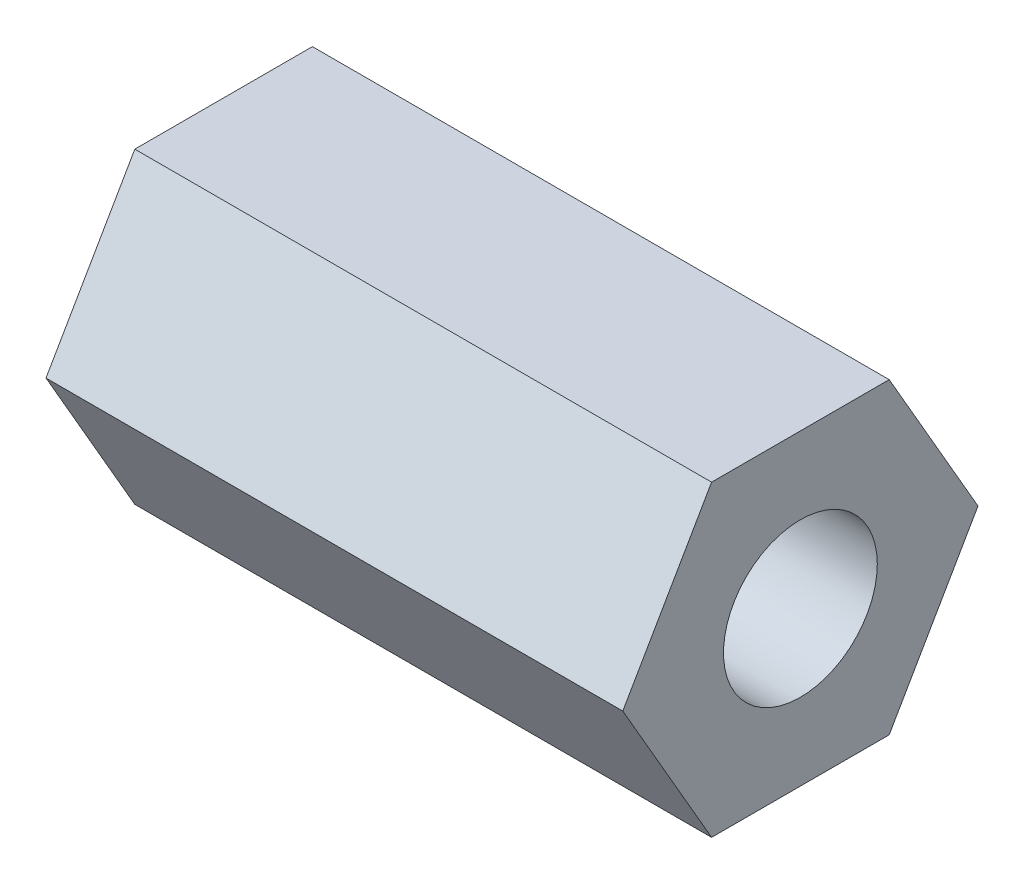
ISO-10303-21;
HEADER;
FILE_DESCRIPTION(('STEP AP214'),'2;1');
FILE_NAME('part.step','',(''),(''),'','','');
FILE_SCHEMA(('AUTOMOTIVE_DESIGN { 1 0 10303 214 1 1 1 1 }'));
ENDSEC;
DATA;
#1=APPLICATION_CONTEXT('core data for automotive mechanical design processes');
#2=APPLICATION_PROTOCOL_DEFINITION('international standard','automotive_design',2000,#1);
#3=PRODUCT_CONTEXT('',#1,'mechanical');
#4=PRODUCT('Part','Part','',(#3));
#5=PRODUCT_RELATED_PRODUCT_CATEGORY('part','',(#4));
#6=PRODUCT_DEFINITION_FORMATION('','',#4);
#7=PRODUCT_DEFINITION_CONTEXT('part definition',#1,'design');
#8=PRODUCT_DEFINITION('design','',#6,#7);
#9=PRODUCT_DEFINITION_SHAPE('','',#8);
#10=(LENGTH_UNIT() NAMED_UNIT(*) SI_UNIT(.MILLI.,.METRE.));
#11=(NAMED_UNIT(*) PLANE_ANGLE_UNIT() SI_UNIT($,.RADIAN.));
#12=(NAMED_UNIT(*) SI_UNIT($,.STERADIAN.) SOLID_ANGLE_UNIT());
#13=UNCERTAINTY_MEASURE_WITH_UNIT(LENGTH_MEASURE(1.E-05),#10,'distance_accuracy_value','');
#14=(GEOMETRIC_REPRESENTATION_CONTEXT(3) GLOBAL_UNCERTAINTY_ASSIGNED_CONTEXT((#13)) GLOBAL_UNIT_ASSIGNED_CONTEXT((#10,
#11,#12)) REPRESENTATION_CONTEXT('',''));
#15=CARTESIAN_POINT('',(0.,0.,0.));
#16=DIRECTION('',(0.,0.,1.));
#17=DIRECTION('',(1.,0.,0.));
#18=AXIS2_PLACEMENT_3D('',#15,#16,#17);
#19=CARTESIAN_POINT('',(15.,0.,0.));
#20=DIRECTION('',(1.,0.,0.));
#21=DIRECTION('',(0.,0.,-1.));
#22=AXIS2_PLACEMENT_3D('',#19,#20,#21);
#23=PLANE('',#22);
#24=DIRECTION('',(0.,0.,-1.));
#25=VECTOR('',#24,1.);
#26=CARTESIAN_POINT('',(15.,-4.,2.3094010767585));
#27=LINE('',#26,#25);
#28=CARTESIAN_POINT('',(15.,-4.,2.3094010767585));
#29=VERTEX_POINT('',#28);
#30=CARTESIAN_POINT('',(15.,-4.,-2.3094010767585));
#31=VERTEX_POINT('',#30);
#32=EDGE_CURVE('E146',#29,#31,#27,.T.);
#33=ORIENTED_EDGE('',*,*,#32,.T.);
#34=DIRECTION('',(0.,0.866025403784439,-0.5));
#35=VECTOR('',#34,1.);
#36=CARTESIAN_POINT('',(15.,-4.,-2.3094010767585));
#37=LINE('',#36,#35);
#38=CARTESIAN_POINT('',(15.,0.,-4.61880215351701));
#39=VERTEX_POINT('',#38);
#40=EDGE_CURVE('E94',#31,#39,#37,.T.);
#41=ORIENTED_EDGE('',*,*,#40,.T.);
#42=DIRECTION('',(0.,0.866025403784438,0.5));
#43=VECTOR('',#42,1.);
#44=CARTESIAN_POINT('',(15.,0.,-4.61880215351701));
#45=LINE('',#44,#43);
#46=CARTESIAN_POINT('',(15.,4.,-2.3094010767585));
#47=VERTEX_POINT('',#46);
#48=EDGE_CURVE('E107',#39,#47,#45,.T.);
#49=ORIENTED_EDGE('',*,*,#48,.T.);
#50=DIRECTION('',(0.,0.,1.));
#51=VECTOR('',#50,1.);
#52=CARTESIAN_POINT('',(15.,4.,-2.3094010767585));
#53=LINE('',#52,#51);
#54=CARTESIAN_POINT('',(15.,4.,2.3094010767585));
#55=VERTEX_POINT('',#54);
#56=EDGE_CURVE('E101',#47,#55,#53,.T.);
#57=ORIENTED_EDGE('',*,*,#56,.T.);
#58=DIRECTION('',(0.,-0.866025403784439,0.5));
#59=VECTOR('',#58,1.);
#60=CARTESIAN_POINT('',(15.,4.,2.3094010767585));
#61=LINE('',#60,#59);
#62=CARTESIAN_POINT('',(15.,0.,4.618802153517));
#63=VERTEX_POINT('',#62);
#64=EDGE_CURVE('E105',#55,#63,#61,.T.);
#65=ORIENTED_EDGE('',*,*,#64,.T.);
#66=DIRECTION('',(0.,-0.866025403784438,-0.5));
#67=VECTOR('',#66,1.);
#68=CARTESIAN_POINT('',(15.,0.,4.618802153517));
#69=LINE('',#68,#67);
#70=EDGE_CURVE('E57',#63,#29,#69,.T.);
#71=ORIENTED_EDGE('',*,*,#70,.T.);
#72=EDGE_LOOP('',(#33,#41,#49,#57,#65,#71));
#73=FACE_BOUND('',#72,.T.);
#74=CARTESIAN_POINT('',(15.,0.,0.));
#75=DIRECTION('',(1.,0.,0.));
#76=DIRECTION('',(0.,0.,-1.));
#77=AXIS2_PLACEMENT_3D('',#74,#75,#76);
#78=CIRCLE('',#77,2.);
#79=CARTESIAN_POINT('',(15.,0.,-2.));
#80=VERTEX_POINT('',#79);
#81=EDGE_CURVE('E134',#80,#80,#78,.T.);
#82=ORIENTED_EDGE('',*,*,#81,.F.);
#83=EDGE_LOOP('',(#82));
#84=FACE_BOUND('',#83,.T.);
#85=ADVANCED_FACE('F39',(#73,#84),#23,.T.);
#86=CARTESIAN_POINT('',(0.,0.,0.));
#87=DIRECTION('',(1.,0.,0.));
#88=DIRECTION('',(0.,0.,-1.));
#89=AXIS2_PLACEMENT_3D('',#86,#87,#88);
#90=PLANE('',#89);
#91=DIRECTION('',(0.,0.,-1.));
#92=VECTOR('',#91,1.);
#93=CARTESIAN_POINT('',(0.,-4.,2.3094010767585));
#94=LINE('',#93,#92);
#95=CARTESIAN_POINT('',(0.,-4.,2.3094010767585));
#96=VERTEX_POINT('',#95);
#97=CARTESIAN_POINT('',(0.,-4.,-2.3094010767585));
#98=VERTEX_POINT('',#97);
#99=EDGE_CURVE('E129',#96,#98,#94,.T.);
#100=ORIENTED_EDGE('',*,*,#99,.F.);
#101=DIRECTION('',(0.,-0.866025403784438,-0.5));
#102=VECTOR('',#101,1.);
#103=CARTESIAN_POINT('',(0.,0.,4.618802153517));
#104=LINE('',#103,#102);
#105=CARTESIAN_POINT('',(0.,0.,4.618802153517));
#106=VERTEX_POINT('',#105);
#107=EDGE_CURVE('E86',#106,#96,#104,.T.);
#108=ORIENTED_EDGE('',*,*,#107,.F.);
#109=DIRECTION('',(0.,-0.866025403784439,0.5));
#110=VECTOR('',#109,1.);
#111=CARTESIAN_POINT('',(0.,4.,2.3094010767585));
#112=LINE('',#111,#110);
#113=CARTESIAN_POINT('',(0.,4.,2.3094010767585));
#114=VERTEX_POINT('',#113);
#115=EDGE_CURVE('E80',#114,#106,#112,.T.);
#116=ORIENTED_EDGE('',*,*,#115,.F.);
#117=DIRECTION('',(0.,0.,1.));
#118=VECTOR('',#117,1.);
#119=CARTESIAN_POINT('',(0.,4.,-2.3094010767585));
#120=LINE('',#119,#118);
#121=CARTESIAN_POINT('',(0.,4.,-2.3094010767585));
#122=VERTEX_POINT('',#121);
#123=EDGE_CURVE('E116',#122,#114,#120,.T.);
#124=ORIENTED_EDGE('',*,*,#123,.F.);
#125=DIRECTION('',(0.,0.866025403784438,0.5));
#126=VECTOR('',#125,1.);
#127=CARTESIAN_POINT('',(0.,0.,-4.61880215351701));
#128=LINE('',#127,#126);
#129=CARTESIAN_POINT('',(0.,0.,-4.61880215351701));
#130=VERTEX_POINT('',#129);
#131=EDGE_CURVE('E137',#130,#122,#128,.T.);
#132=ORIENTED_EDGE('',*,*,#131,.F.);
#133=DIRECTION('',(0.,0.866025403784439,-0.5));
#134=VECTOR('',#133,1.);
#135=CARTESIAN_POINT('',(0.,-4.,-2.3094010767585));
#136=LINE('',#135,#134);
#137=EDGE_CURVE('E133',#98,#130,#136,.T.);
#138=ORIENTED_EDGE('',*,*,#137,.F.);
#139=EDGE_LOOP('',(#100,#108,#116,#124,#132,#138));
#140=FACE_BOUND('',#139,.T.);
#141=CARTESIAN_POINT('',(0.,0.,0.));
#142=DIRECTION('',(1.,0.,0.));
#143=DIRECTION('',(0.,0.,-1.));
#144=AXIS2_PLACEMENT_3D('',#141,#142,#143);
#145=CIRCLE('',#144,2.);
#146=CARTESIAN_POINT('',(0.,0.,-2.));
#147=VERTEX_POINT('',#146);
#148=EDGE_CURVE('E243',#147,#147,#145,.T.);
#149=ORIENTED_EDGE('',*,*,#148,.T.);
#150=EDGE_LOOP('',(#149));
#151=FACE_BOUND('',#150,.T.);
#152=ADVANCED_FACE('F159',(#140,#151),#90,.F.);
#153=CARTESIAN_POINT('',(15.,-4.,2.3094010767585));
#154=DIRECTION('',(0.,1.,0.));
#155=DIRECTION('',(0.,0.,1.));
#156=AXIS2_PLACEMENT_3D('',#153,#154,#155);
#157=PLANE('',#156);
#158=ORIENTED_EDGE('',*,*,#99,.T.);
#159=DIRECTION('',(-1.,0.,0.));
#160=VECTOR('',#159,1.);
#161=CARTESIAN_POINT('',(15.,-4.,-2.3094010767585));
#162=LINE('',#161,#160);
#163=EDGE_CURVE('E11',#31,#98,#162,.T.);
#164=ORIENTED_EDGE('',*,*,#163,.F.);
#165=ORIENTED_EDGE('',*,*,#32,.F.);
#166=DIRECTION('',(-1.,0.,0.));
#167=VECTOR('',#166,1.);
#168=CARTESIAN_POINT('',(15.,-4.,2.3094010767585));
#169=LINE('',#168,#167);
#170=EDGE_CURVE('E125',#29,#96,#169,.T.);
#171=ORIENTED_EDGE('',*,*,#170,.T.);
#172=EDGE_LOOP('',(#158,#164,#165,#171));
#173=FACE_BOUND('',#172,.T.);
#174=ADVANCED_FACE('F41',(#173),#157,.F.);
#175=CARTESIAN_POINT('',(15.,-4.,-2.3094010767585));
#176=DIRECTION('',(0.,0.5,0.866025403784439));
#177=DIRECTION('',(0.,-0.866025403784439,0.5));
#178=AXIS2_PLACEMENT_3D('',#175,#176,#177);
#179=PLANE('',#178);
#180=ORIENTED_EDGE('',*,*,#137,.T.);
#181=DIRECTION('',(-1.,0.,0.));
#182=VECTOR('',#181,1.);
#183=CARTESIAN_POINT('',(15.,0.,-4.61880215351701));
#184=LINE('',#183,#182);
#185=EDGE_CURVE('E49',#39,#130,#184,.T.);
#186=ORIENTED_EDGE('',*,*,#185,.F.);
#187=ORIENTED_EDGE('',*,*,#40,.F.);
#188=ORIENTED_EDGE('',*,*,#163,.T.);
#189=EDGE_LOOP('',(#180,#186,#187,#188));
#190=FACE_BOUND('',#189,.T.);
#191=ADVANCED_FACE('F184',(#190),#179,.F.);
#192=CARTESIAN_POINT('',(15.,0.,-4.61880215351701));
#193=DIRECTION('',(0.,-0.5,0.866025403784438));
#194=DIRECTION('',(0.,-0.866025403784439,-0.5));
#195=AXIS2_PLACEMENT_3D('',#192,#193,#194);
#196=PLANE('',#195);
#197=ORIENTED_EDGE('',*,*,#131,.T.);
#198=DIRECTION('',(-1.,0.,0.));
#199=VECTOR('',#198,1.);
#200=CARTESIAN_POINT('',(15.,4.,-2.3094010767585));
#201=LINE('',#200,#199);
#202=EDGE_CURVE('E118',#47,#122,#201,.T.);
#203=ORIENTED_EDGE('',*,*,#202,.F.);
#204=ORIENTED_EDGE('',*,*,#48,.F.);
#205=ORIENTED_EDGE('',*,*,#185,.T.);
#206=EDGE_LOOP('',(#197,#203,#204,#205));
#207=FACE_BOUND('',#206,.T.);
#208=ADVANCED_FACE('F156',(#207),#196,.F.);
#209=CARTESIAN_POINT('',(15.,4.,-2.3094010767585));
#210=DIRECTION('',(0.,-1.,0.));
#211=DIRECTION('',(0.,0.,-1.));
#212=AXIS2_PLACEMENT_3D('',#209,#210,#211);
#213=PLANE('',#212);
#214=ORIENTED_EDGE('',*,*,#123,.T.);
#215=DIRECTION('',(-1.,0.,0.));
#216=VECTOR('',#215,1.);
#217=CARTESIAN_POINT('',(15.,4.,2.3094010767585));
#218=LINE('',#217,#216);
#219=EDGE_CURVE('E113',#55,#114,#218,.T.);
#220=ORIENTED_EDGE('',*,*,#219,.F.);
#221=ORIENTED_EDGE('',*,*,#56,.F.);
#222=ORIENTED_EDGE('',*,*,#202,.T.);
#223=EDGE_LOOP('',(#214,#220,#221,#222));
#224=FACE_BOUND('',#223,.T.);
#225=ADVANCED_FACE('F114',(#224),#213,.F.);
#226=CARTESIAN_POINT('',(15.,4.,2.3094010767585));
#227=DIRECTION('',(0.,-0.5,-0.866025403784438));
#228=DIRECTION('',(0.,0.866025403784439,-0.5));
#229=AXIS2_PLACEMENT_3D('',#226,#227,#228);
#230=PLANE('',#229);
#231=ORIENTED_EDGE('',*,*,#115,.T.);
#232=DIRECTION('',(-1.,0.,0.));
#233=VECTOR('',#232,1.);
#234=CARTESIAN_POINT('',(15.,0.,4.618802153517));
#235=LINE('',#234,#233);
#236=EDGE_CURVE('E119',#63,#106,#235,.T.);
#237=ORIENTED_EDGE('',*,*,#236,.F.);
#238=ORIENTED_EDGE('',*,*,#64,.F.);
#239=ORIENTED_EDGE('',*,*,#219,.T.);
#240=EDGE_LOOP('',(#231,#237,#238,#239));
#241=FACE_BOUND('',#240,.T.);
#242=ADVANCED_FACE('F121',(#241),#230,.F.);
#243=CARTESIAN_POINT('',(15.,0.,4.618802153517));
#244=DIRECTION('',(0.,0.5,-0.866025403784438));
#245=DIRECTION('',(0.,0.866025403784438,0.5));
#246=AXIS2_PLACEMENT_3D('',#243,#244,#245);
#247=PLANE('',#246);
#248=ORIENTED_EDGE('',*,*,#107,.T.);
#249=ORIENTED_EDGE('',*,*,#170,.F.);
#250=ORIENTED_EDGE('',*,*,#70,.F.);
#251=ORIENTED_EDGE('',*,*,#236,.T.);
#252=EDGE_LOOP('',(#248,#249,#250,#251));
#253=FACE_BOUND('',#252,.T.);
#254=ADVANCED_FACE('F164',(#253),#247,.F.);
#255=CARTESIAN_POINT('',(15.,0.,0.));
#256=DIRECTION('',(-1.,0.,0.));
#257=DIRECTION('',(0.,0.,1.));
#258=AXIS2_PLACEMENT_3D('',#255,#256,#257);
#259=CYLINDRICAL_SURFACE('',#258,2.);
#260=ORIENTED_EDGE('',*,*,#81,.T.);
#261=EDGE_LOOP('',(#260));
#262=FACE_BOUND('',#261,.T.);
#263=ORIENTED_EDGE('',*,*,#148,.F.);
#264=EDGE_LOOP('',(#263));
#265=FACE_BOUND('',#264,.T.);
#266=ADVANCED_FACE('F166',(#262,#265),#259,.F.);
#267=CLOSED_SHELL('',(#85,#152,#174,#191,#208,#225,#242,#254,#266));
#268=MANIFOLD_SOLID_BREP('B2',#267);
#269=ADVANCED_BREP_SHAPE_REPRESENTATION('',(#18,#268),#14);
#270=SHAPE_DEFINITION_REPRESENTATION(#9,#269);
ENDSEC;
END-ISO-10303-21;
